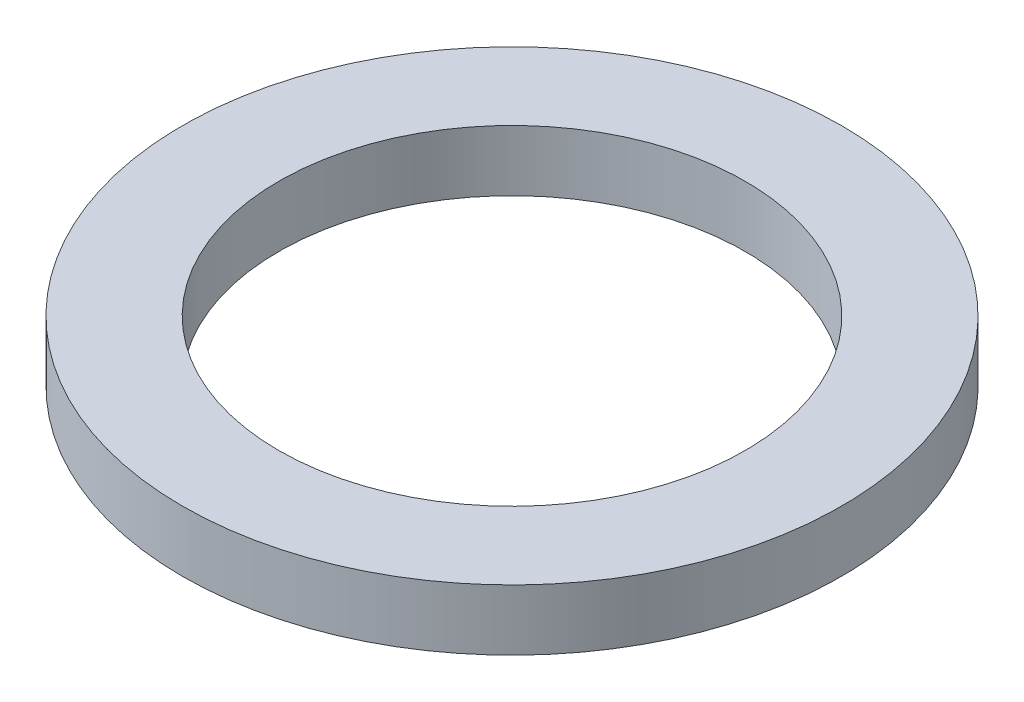
ISO-10303-21;
HEADER;
FILE_DESCRIPTION(('STEP AP214'),'2;1');
FILE_NAME('part.step','',(''),(''),'','','');
FILE_SCHEMA(('AUTOMOTIVE_DESIGN { 1 0 10303 214 1 1 1 1 }'));
ENDSEC;
DATA;
#1=APPLICATION_CONTEXT('core data for automotive mechanical design processes');
#2=APPLICATION_PROTOCOL_DEFINITION('international standard','automotive_design',2000,#1);
#3=PRODUCT_CONTEXT('',#1,'mechanical');
#4=PRODUCT('Part','Part','',(#3));
#5=PRODUCT_RELATED_PRODUCT_CATEGORY('part','',(#4));
#6=PRODUCT_DEFINITION_FORMATION('','',#4);
#7=PRODUCT_DEFINITION_CONTEXT('part definition',#1,'design');
#8=PRODUCT_DEFINITION('design','',#6,#7);
#9=PRODUCT_DEFINITION_SHAPE('','',#8);
#10=(LENGTH_UNIT() NAMED_UNIT(*) SI_UNIT(.MILLI.,.METRE.));
#11=(NAMED_UNIT(*) PLANE_ANGLE_UNIT() SI_UNIT($,.RADIAN.));
#12=(NAMED_UNIT(*) SI_UNIT($,.STERADIAN.) SOLID_ANGLE_UNIT());
#13=UNCERTAINTY_MEASURE_WITH_UNIT(LENGTH_MEASURE(1.E-05),#10,'distance_accuracy_value','');
#14=(GEOMETRIC_REPRESENTATION_CONTEXT(3) GLOBAL_UNCERTAINTY_ASSIGNED_CONTEXT((#13)) GLOBAL_UNIT_ASSIGNED_CONTEXT((#10,
#11,#12)) REPRESENTATION_CONTEXT('',''));
#15=CARTESIAN_POINT('',(0.,0.,0.));
#16=DIRECTION('',(0.,0.,1.));
#17=DIRECTION('',(1.,0.,0.));
#18=AXIS2_PLACEMENT_3D('',#15,#16,#17);
#19=CARTESIAN_POINT('',(0.,6.,0.));
#20=DIRECTION('',(0.,1.,0.));
#21=DIRECTION('',(0.,0.,1.));
#22=AXIS2_PLACEMENT_3D('',#19,#20,#21);
#23=PLANE('',#22);
#24=CARTESIAN_POINT('',(0.,6.,0.));
#25=DIRECTION('',(0.,1.,0.));
#26=DIRECTION('',(0.,0.,1.));
#27=AXIS2_PLACEMENT_3D('',#24,#25,#26);
#28=CIRCLE('',#27,32.5);
#29=CARTESIAN_POINT('',(0.,6.,32.5));
#30=VERTEX_POINT('',#29);
#31=EDGE_CURVE('E10',#30,#30,#28,.T.);
#32=ORIENTED_EDGE('',*,*,#31,.T.);
#33=EDGE_LOOP('',(#32));
#34=FACE_BOUND('',#33,.T.);
#35=CARTESIAN_POINT('',(0.,6.,0.));
#36=DIRECTION('',(0.,1.,0.));
#37=DIRECTION('',(0.,0.,1.));
#38=AXIS2_PLACEMENT_3D('',#35,#36,#37);
#39=CIRCLE('',#38,23.);
#40=CARTESIAN_POINT('',(0.,6.,23.));
#41=VERTEX_POINT('',#40);
#42=EDGE_CURVE('E44',#41,#41,#39,.T.);
#43=ORIENTED_EDGE('',*,*,#42,.F.);
#44=EDGE_LOOP('',(#43));
#45=FACE_BOUND('',#44,.T.);
#46=ADVANCED_FACE('F33',(#34,#45),#23,.T.);
#47=CARTESIAN_POINT('',(0.,0.,0.));
#48=DIRECTION('',(0.,1.,0.));
#49=DIRECTION('',(0.,0.,1.));
#50=AXIS2_PLACEMENT_3D('',#47,#48,#49);
#51=PLANE('',#50);
#52=CARTESIAN_POINT('',(0.,0.,0.));
#53=DIRECTION('',(0.,1.,0.));
#54=DIRECTION('',(0.,0.,1.));
#55=AXIS2_PLACEMENT_3D('',#52,#53,#54);
#56=CIRCLE('',#55,32.5);
#57=CARTESIAN_POINT('',(0.,0.,32.5));
#58=VERTEX_POINT('',#57);
#59=EDGE_CURVE('E37',#58,#58,#56,.T.);
#60=ORIENTED_EDGE('',*,*,#59,.F.);
#61=EDGE_LOOP('',(#60));
#62=FACE_BOUND('',#61,.T.);
#63=CARTESIAN_POINT('',(0.,0.,0.));
#64=DIRECTION('',(0.,1.,0.));
#65=DIRECTION('',(0.,0.,1.));
#66=AXIS2_PLACEMENT_3D('',#63,#64,#65);
#67=CIRCLE('',#66,23.);
#68=CARTESIAN_POINT('',(0.,0.,23.));
#69=VERTEX_POINT('',#68);
#70=EDGE_CURVE('E46',#69,#69,#67,.T.);
#71=ORIENTED_EDGE('',*,*,#70,.T.);
#72=EDGE_LOOP('',(#71));
#73=FACE_BOUND('',#72,.T.);
#74=ADVANCED_FACE('F56',(#62,#73),#51,.F.);
#75=CARTESIAN_POINT('',(0.,6.,0.));
#76=DIRECTION('',(0.,-1.,0.));
#77=DIRECTION('',(0.,0.,-1.));
#78=AXIS2_PLACEMENT_3D('',#75,#76,#77);
#79=CYLINDRICAL_SURFACE('',#78,32.5);
#80=ORIENTED_EDGE('',*,*,#31,.F.);
#81=EDGE_LOOP('',(#80));
#82=FACE_BOUND('',#81,.T.);
#83=ORIENTED_EDGE('',*,*,#59,.T.);
#84=EDGE_LOOP('',(#83));
#85=FACE_BOUND('',#84,.T.);
#86=ADVANCED_FACE('F35',(#82,#85),#79,.T.);
#87=CARTESIAN_POINT('',(0.,6.,0.));
#88=DIRECTION('',(0.,-1.,0.));
#89=DIRECTION('',(0.,0.,-1.));
#90=AXIS2_PLACEMENT_3D('',#87,#88,#89);
#91=CYLINDRICAL_SURFACE('',#90,23.);
#92=ORIENTED_EDGE('',*,*,#42,.T.);
#93=EDGE_LOOP('',(#92));
#94=FACE_BOUND('',#93,.T.);
#95=ORIENTED_EDGE('',*,*,#70,.F.);
#96=EDGE_LOOP('',(#95));
#97=FACE_BOUND('',#96,.T.);
#98=ADVANCED_FACE('F52',(#94,#97),#91,.F.);
#99=CLOSED_SHELL('',(#46,#74,#86,#98));
#100=MANIFOLD_SOLID_BREP('B2',#99);
#101=ADVANCED_BREP_SHAPE_REPRESENTATION('',(#18,#100),#14);
#102=SHAPE_DEFINITION_REPRESENTATION(#9,#101);
ENDSEC;
END-ISO-10303-21;
